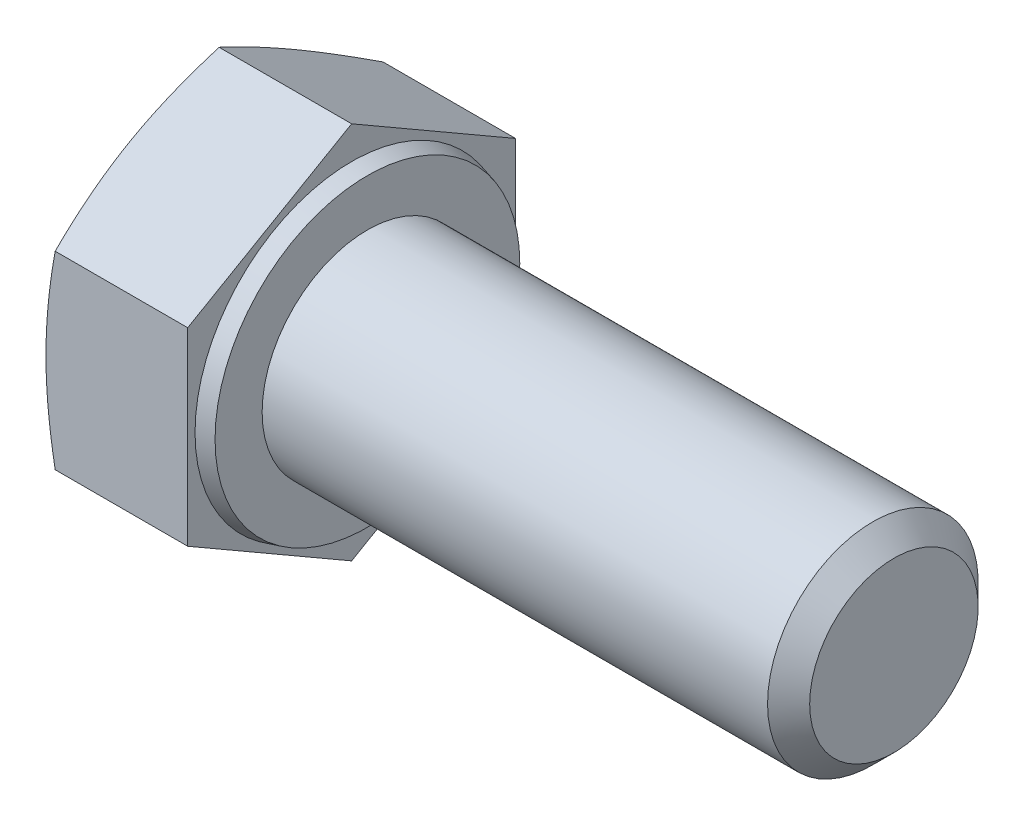
ISO-10303-21;
HEADER;
FILE_DESCRIPTION(('STEP AP214'),'2;1');
FILE_NAME('part.step','',(''),(''),'','','');
FILE_SCHEMA(('AUTOMOTIVE_DESIGN { 1 0 10303 214 1 1 1 1 }'));
ENDSEC;
DATA;
#1=APPLICATION_CONTEXT('core data for automotive mechanical design processes');
#2=APPLICATION_PROTOCOL_DEFINITION('international standard','automotive_design',2000,#1);
#3=PRODUCT_CONTEXT('',#1,'mechanical');
#4=PRODUCT('Part','Part','',(#3));
#5=PRODUCT_RELATED_PRODUCT_CATEGORY('part','',(#4));
#6=PRODUCT_DEFINITION_FORMATION('','',#4);
#7=PRODUCT_DEFINITION_CONTEXT('part definition',#1,'design');
#8=PRODUCT_DEFINITION('design','',#6,#7);
#9=PRODUCT_DEFINITION_SHAPE('','',#8);
#10=(LENGTH_UNIT() NAMED_UNIT(*) SI_UNIT(.MILLI.,.METRE.));
#11=(NAMED_UNIT(*) PLANE_ANGLE_UNIT() SI_UNIT($,.RADIAN.));
#12=(NAMED_UNIT(*) SI_UNIT($,.STERADIAN.) SOLID_ANGLE_UNIT());
#13=UNCERTAINTY_MEASURE_WITH_UNIT(LENGTH_MEASURE(1.E-05),#10,'distance_accuracy_value','');
#14=(GEOMETRIC_REPRESENTATION_CONTEXT(3) GLOBAL_UNCERTAINTY_ASSIGNED_CONTEXT((#13)) GLOBAL_UNIT_ASSIGNED_CONTEXT((#10,
#11,#12)) REPRESENTATION_CONTEXT('',''));
#15=CARTESIAN_POINT('',(0.,0.,0.));
#16=DIRECTION('',(0.,0.,1.));
#17=DIRECTION('',(1.,0.,0.));
#18=AXIS2_PLACEMENT_3D('',#15,#16,#17);
#19=CARTESIAN_POINT('',(20.6,-3.595,-6.22672265321011));
#20=DIRECTION('',(0.,-0.866025403784439,-0.5));
#21=DIRECTION('',(0.,0.5,-0.866025403784439));
#22=AXIS2_PLACEMENT_3D('',#19,#20,#21);
#23=PLANE('',#22);
#24=DIRECTION('',(-1.,0.,0.));
#25=VECTOR('',#24,1.);
#26=CARTESIAN_POINT('',(20.6,-7.19,0.));
#27=LINE('',#26,#25);
#28=CARTESIAN_POINT('',(0.,-7.19,0.));
#29=VERTEX_POINT('',#28);
#30=CARTESIAN_POINT('',(-5.03389102967511,-7.19,0.));
#31=VERTEX_POINT('',#30);
#32=EDGE_CURVE('E57',#29,#31,#27,.T.);
#33=ORIENTED_EDGE('',*,*,#32,.T.);
#34=CARTESIAN_POINT('',(-5.03384900100014,-7.19011547005384,0.0002));
#35=CARTESIAN_POINT('',(-5.08805963076519,-7.04122910407722,-0.257678750425791));
#36=CARTESIAN_POINT('',(-5.13737359308155,-6.89185177286806,-0.516407877579102));
#37=CARTESIAN_POINT('',(-5.22413389520894,-6.59212583670845,-1.0355484273537));
#38=CARTESIAN_POINT('',(-5.26157094835133,-6.44177656505055,-1.29596100474615));
#39=CARTESIAN_POINT('',(-5.32212431475841,-6.14177529234696,-1.81557845140411));
#40=CARTESIAN_POINT('',(-5.34537270513493,-5.99213014273963,-2.07477145363024));
#41=CARTESIAN_POINT('',(-5.37655533214507,-5.69248989384581,-2.59376358870692));
#42=CARTESIAN_POINT('',(-5.38449531124956,-5.54249494692291,-2.85356245765599));
#43=CARTESIAN_POINT('',(-5.38449531124956,-5.2425050530771,-3.37316019555412));
#44=CARTESIAN_POINT('',(-5.37655533214507,-5.09251010615419,-3.63295906450319));
#45=CARTESIAN_POINT('',(-5.34537270513493,-4.79286985726037,-4.15195119957987));
#46=CARTESIAN_POINT('',(-5.32212431475841,-4.64322470765305,-4.41114420180601));
#47=CARTESIAN_POINT('',(-5.26157094835133,-4.34322343494945,-4.93076164846397));
#48=CARTESIAN_POINT('',(-5.22413389520894,-4.19287416329156,-5.19117422585641));
#49=CARTESIAN_POINT('',(-5.13737359308155,-3.89314822713194,-5.71031477563101));
#50=CARTESIAN_POINT('',(-5.08805963076518,-3.74377089592278,-5.96904390278432));
#51=CARTESIAN_POINT('',(-5.03384900100014,-3.59488452994616,-6.22692265321011));
#52=B_SPLINE_CURVE_WITH_KNOTS('',3,(#34,#35,#36,#37,#38,#39,#40,#41,#42,#43,#44,#45,#46,#47,#48,
#49,#50,#51),.UNSPECIFIED.,.F.,.F.,(4,2,2,2,2,2,2,2,4),(0.,0.908095057252449,1.81689842260343,
2.71710763162562,3.61697908961632,4.51685054760702,5.41705975662921,6.32586312198019,
7.23395817923264),.UNSPECIFIED.);
#53=CARTESIAN_POINT('',(-5.03389102967511,-3.595,-6.22672265321011));
#54=VERTEX_POINT('',#53);
#55=EDGE_CURVE('E50',#31,#54,#52,.T.);
#56=ORIENTED_EDGE('',*,*,#55,.T.);
#57=DIRECTION('',(-1.,0.,0.));
#58=VECTOR('',#57,1.);
#59=CARTESIAN_POINT('',(20.6,-3.595,-6.22672265321011));
#60=LINE('',#59,#58);
#61=CARTESIAN_POINT('',(0.,-3.595,-6.22672265321011));
#62=VERTEX_POINT('',#61);
#63=EDGE_CURVE('E123',#62,#54,#60,.T.);
#64=ORIENTED_EDGE('',*,*,#63,.F.);
#65=DIRECTION('',(0.,-0.5,0.866025403784439));
#66=VECTOR('',#65,1.);
#67=CARTESIAN_POINT('',(0.,-3.595,-6.22672265321011));
#68=LINE('',#67,#66);
#69=EDGE_CURVE('E138',#62,#29,#68,.T.);
#70=ORIENTED_EDGE('',*,*,#69,.T.);
#71=EDGE_LOOP('',(#33,#56,#64,#70));
#72=FACE_BOUND('',#71,.T.);
#73=ADVANCED_FACE('F35',(#72),#23,.T.);
#74=CARTESIAN_POINT('',(20.6,3.595,-6.22672265321011));
#75=DIRECTION('',(0.,0.,-1.));
#76=DIRECTION('',(0.,1.,0.));
#77=AXIS2_PLACEMENT_3D('',#74,#75,#76);
#78=PLANE('',#77);
#79=ORIENTED_EDGE('',*,*,#63,.T.);
#80=CARTESIAN_POINT('',(-3.51290350463359,-9.51206244699165,-6.22672265321012));
#81=CARTESIAN_POINT('',(-3.59865067374366,-9.23040678020694,-6.22672265321012));
#82=CARTESIAN_POINT('',(-3.68339590180722,-8.948440403835,-6.22672265321012));
#83=CARTESIAN_POINT('',(-3.85032818164455,-8.38372806074036,-6.22672265321012));
#84=CARTESIAN_POINT('',(-3.93251503051058,-8.10098203410892,-6.22672265321012));
#85=CARTESIAN_POINT('',(-4.09391336009,-7.53406688733044,-6.22672265321012));
#86=CARTESIAN_POINT('',(-4.17311898619305,-7.24989609436889,-6.22672265321012));
#87=CARTESIAN_POINT('',(-4.32762595897665,-6.68049654285568,-6.22672265321012));
#88=CARTESIAN_POINT('',(-4.40292737592697,-6.39526780344452,-6.22672265321012));
#89=CARTESIAN_POINT('',(-4.54775778410175,-5.82709836820566,-6.22672265321012));
#90=CARTESIAN_POINT('',(-4.61734665667,-5.54417301266554,-6.22672265321011));
#91=CARTESIAN_POINT('',(-4.75059032929027,-4.97691372635876,-6.22672265321011));
#92=CARTESIAN_POINT('',(-4.81424502941142,-4.69257977195632,-6.22672265321011));
#93=CARTESIAN_POINT('',(-4.93413428437026,-4.12244081187139,-6.22672265321011));
#94=CARTESIAN_POINT('',(-4.99037139100831,-3.83663634741487,-6.22672265321011));
#95=CARTESIAN_POINT('',(-5.09371134025047,-3.26336845733878,-6.22672265321011));
#96=CARTESIAN_POINT('',(-5.14081448967723,-2.97590508777835,-6.22672265321011));
#97=CARTESIAN_POINT('',(-5.21930699352353,-2.43170060088507,-6.22672265321011));
#98=CARTESIAN_POINT('',(-5.2518662377399,-2.17512980718482,-6.22672265321011));
#99=CARTESIAN_POINT('',(-5.30696049565407,-1.66090521643882,-6.22672265321011));
#100=CARTESIAN_POINT('',(-5.32949580170818,-1.4032514512001,-6.22672265321011));
#101=CARTESIAN_POINT('',(-5.36345683516162,-0.887383641140857,-6.22672265321011));
#102=CARTESIAN_POINT('',(-5.37489039669814,-0.629170120469072,-6.22672265321011));
#103=CARTESIAN_POINT('',(-5.38606924306082,-0.112487483798661,-6.22672265321011));
#104=CARTESIAN_POINT('',(-5.38581460886695,0.145981630416715,-6.22672265321011));
#105=CARTESIAN_POINT('',(-5.37359991738923,0.663954843197887,-6.22672265321011));
#106=CARTESIAN_POINT('',(-5.36158028737254,0.923457513564079,-6.22672265321011));
#107=CARTESIAN_POINT('',(-5.32638854200036,1.44169898088408,-6.22672265321011));
#108=CARTESIAN_POINT('',(-5.30321615879705,1.70043775934188,-6.22672265321011));
#109=CARTESIAN_POINT('',(-5.24680158753448,2.21702436160621,-6.22672265321011));
#110=CARTESIAN_POINT('',(-5.21355075970606,2.47487122824474,-6.22672265321011));
#111=CARTESIAN_POINT('',(-5.1383262138086,2.98927496857798,-6.22672265321011));
#112=CARTESIAN_POINT('',(-5.09635245030345,3.24583183554621,-6.22672265321011));
#113=CARTESIAN_POINT('',(-5.00254996252867,3.77161154258582,-6.22672265321011));
#114=CARTESIAN_POINT('',(-4.95030790362126,4.0407599866922,-6.22672265321011));
#115=CARTESIAN_POINT('',(-4.83910100557231,4.57767329922066,-6.22672265321011));
#116=CARTESIAN_POINT('',(-4.78013565803658,4.84543806141054,-6.22672265321011));
#117=CARTESIAN_POINT('',(-4.65672193019494,5.37977561536939,-6.22672265321011));
#118=CARTESIAN_POINT('',(-4.59227195307975,5.64634803605647,-6.22672265321011));
#119=CARTESIAN_POINT('',(-4.45893792515359,6.17836938091286,-6.22672265321011));
#120=CARTESIAN_POINT('',(-4.39005398100717,6.44381833194503,-6.22672265321011));
#121=CARTESIAN_POINT('',(-4.24859250088054,6.97409102138935,-6.22672265321011));
#122=CARTESIAN_POINT('',(-4.17601034700023,7.2389135235188,-6.22672265321011));
#123=CARTESIAN_POINT('',(-4.02789200488949,7.76773266668567,-6.22672265321011));
#124=CARTESIAN_POINT('',(-3.95235577317997,8.0317292955058,-6.22672265321011));
#125=CARTESIAN_POINT('',(-3.7221641328738,8.82257156289593,-6.22672265321011));
#126=CARTESIAN_POINT('',(-3.56389961609156,9.3483659936652,-6.22672265321011));
#127=CARTESIAN_POINT('',(-3.24257396471912,10.3920660350929,-6.22672265321011));
#128=CARTESIAN_POINT('',(-3.07958583733744,10.9099943074093,-6.22672265321011));
#129=CARTESIAN_POINT('',(-2.74898726190027,11.9443978872245,-6.22672265321011));
#130=CARTESIAN_POINT('',(-2.5813765914879,12.4608731235069,-6.22672265321011));
#131=CARTESIAN_POINT('',(-2.24342037080104,13.4907541310804,-6.22672265321011));
#132=CARTESIAN_POINT('',(-2.07308761745729,14.0041641118251,-6.22672265321011));
#133=CARTESIAN_POINT('',(-1.81570195648708,14.77362367697,-6.22672265321011));
#134=CARTESIAN_POINT('',(-1.7295958228759,15.0299906446384,-6.22672265321011));
#135=CARTESIAN_POINT('',(-1.55682750223247,15.5425364828865,-6.22672265321011));
#136=CARTESIAN_POINT('',(-1.47016531655149,15.7987153539217,-6.22672265321011));
#137=CARTESIAN_POINT('',(-1.38326239219643,16.0548125224615,-6.22672265321011));
#138=B_SPLINE_CURVE_WITH_KNOTS('',3,(#80,#81,#82,#83,#84,#85,#86,#87,#88,#89,#90,#91,#92,#93,
#94,#95,#96,#97,#98,#99,#100,#101,#102,#103,#104,#105,#106,#107,#108,#109,#110,#111,#112,#113,
#114,#115,#116,#117,#118,#119,#120,#121,#122,#123,#124,#125,#126,#127,#128,#129,#130,#131,#132,
#133,#134,#135,#136,#137),.UNSPECIFIED.,.F.,.F.,(4,2,2,2,2,2,2,2,2,2,2,2,2,2,2,2,2,2,2,2,2,2,2,
2,2,2,2,2,4),(0.,0.883262987783514,1.76659585051986,2.65158142631617,3.53655106819753,
4.41057390114665,5.28461144989435,6.15834752361641,7.03205424221161,7.80776909780132,
8.58346132755328,9.35860577805133,10.1337448580756,10.9128293116603,11.6919324769004,
12.4717054281399,13.2514824411686,14.0738921575776,14.8963641033477,15.7190763303775,
16.5417687734372,17.3655149556542,18.1892732666067,19.8364902464891,21.4653706257557,
23.094329495726,24.7171047884872,25.5284270364797,26.3397473136057),.UNSPECIFIED.);
#139=CARTESIAN_POINT('',(-5.03389102967511,3.595,-6.22672265321011));
#140=VERTEX_POINT('',#139);
#141=EDGE_CURVE('E179',#54,#140,#138,.T.);
#142=ORIENTED_EDGE('',*,*,#141,.T.);
#143=DIRECTION('',(-1.,0.,0.));
#144=VECTOR('',#143,1.);
#145=CARTESIAN_POINT('',(20.6,3.595,-6.22672265321011));
#146=LINE('',#145,#144);
#147=CARTESIAN_POINT('',(0.,3.595,-6.22672265321011));
#148=VERTEX_POINT('',#147);
#149=EDGE_CURVE('E113',#148,#140,#146,.T.);
#150=ORIENTED_EDGE('',*,*,#149,.F.);
#151=DIRECTION('',(0.,-1.,0.));
#152=VECTOR('',#151,1.);
#153=CARTESIAN_POINT('',(0.,7.19,-6.22672265321011));
#154=LINE('',#153,#152);
#155=EDGE_CURVE('E136',#148,#62,#154,.T.);
#156=ORIENTED_EDGE('',*,*,#155,.T.);
#157=EDGE_LOOP('',(#79,#142,#150,#156));
#158=FACE_BOUND('',#157,.T.);
#159=ADVANCED_FACE('F154',(#158),#78,.T.);
#160=CARTESIAN_POINT('',(20.6,7.19,0.));
#161=DIRECTION('',(0.,0.866025403784438,-0.5));
#162=DIRECTION('',(0.,0.5,0.866025403784439));
#163=AXIS2_PLACEMENT_3D('',#160,#161,#162);
#164=PLANE('',#163);
#165=ORIENTED_EDGE('',*,*,#149,.T.);
#166=CARTESIAN_POINT('',(-5.03384900100014,3.59488452994616,-6.22692265321011));
#167=CARTESIAN_POINT('',(-5.08805963076519,3.74377089592278,-5.96904390278432));
#168=CARTESIAN_POINT('',(-5.13737359308155,3.89314822713194,-5.71031477563101));
#169=CARTESIAN_POINT('',(-5.22413389520894,4.19287416329156,-5.19117422585641));
#170=CARTESIAN_POINT('',(-5.26157094835133,4.34322343494945,-4.93076164846397));
#171=CARTESIAN_POINT('',(-5.32212431475841,4.64322470765305,-4.41114420180601));
#172=CARTESIAN_POINT('',(-5.34537270513493,4.79286985726037,-4.15195119957987));
#173=CARTESIAN_POINT('',(-5.37655533214507,5.09251010615419,-3.63295906450319));
#174=CARTESIAN_POINT('',(-5.38449531124956,5.2425050530771,-3.37316019555412));
#175=CARTESIAN_POINT('',(-5.38449531124956,5.54249494692291,-2.85356245765599));
#176=CARTESIAN_POINT('',(-5.37655533214507,5.69248989384581,-2.59376358870692));
#177=CARTESIAN_POINT('',(-5.34537270513493,5.99213014273963,-2.07477145363024));
#178=CARTESIAN_POINT('',(-5.32212431475841,6.14177529234696,-1.81557845140411));
#179=CARTESIAN_POINT('',(-5.26157094835133,6.44177656505056,-1.29596100474615));
#180=CARTESIAN_POINT('',(-5.22413389520894,6.59212583670845,-1.0355484273537));
#181=CARTESIAN_POINT('',(-5.13737359308155,6.89185177286806,-0.516407877579103));
#182=CARTESIAN_POINT('',(-5.08805963076518,7.04122910407722,-0.257678750425792));
#183=CARTESIAN_POINT('',(-5.03384900100014,7.19011547005384,0.000199999999999125));
#184=B_SPLINE_CURVE_WITH_KNOTS('',3,(#166,#167,#168,#169,#170,#171,#172,#173,#174,#175,#176,
#177,#178,#179,#180,#181,#182,#183),.UNSPECIFIED.,.F.,.F.,(4,2,2,2,2,2,2,2,4),(0.,
0.908095057252449,1.81689842260343,2.71710763162562,3.61697908961632,4.51685054760702,
5.41705975662921,6.32586312198019,7.23395817923264),.UNSPECIFIED.);
#185=CARTESIAN_POINT('',(-5.03389102967511,7.19,0.));
#186=VERTEX_POINT('',#185);
#187=EDGE_CURVE('E106',#140,#186,#184,.T.);
#188=ORIENTED_EDGE('',*,*,#187,.T.);
#189=DIRECTION('',(-1.,0.,0.));
#190=VECTOR('',#189,1.);
#191=CARTESIAN_POINT('',(20.6,7.19,0.));
#192=LINE('',#191,#190);
#193=CARTESIAN_POINT('',(0.,7.19,0.));
#194=VERTEX_POINT('',#193);
#195=EDGE_CURVE('E105',#194,#186,#192,.T.);
#196=ORIENTED_EDGE('',*,*,#195,.F.);
#197=DIRECTION('',(0.,-0.5,-0.866025403784439));
#198=VECTOR('',#197,1.);
#199=CARTESIAN_POINT('',(0.,7.19,0.));
#200=LINE('',#199,#198);
#201=EDGE_CURVE('E134',#194,#148,#200,.T.);
#202=ORIENTED_EDGE('',*,*,#201,.T.);
#203=EDGE_LOOP('',(#165,#188,#196,#202));
#204=FACE_BOUND('',#203,.T.);
#205=ADVANCED_FACE('F160',(#204),#164,.T.);
#206=CARTESIAN_POINT('',(20.6,3.595,6.22672265321012));
#207=DIRECTION('',(0.,0.866025403784439,0.5));
#208=DIRECTION('',(0.,-0.5,0.866025403784439));
#209=AXIS2_PLACEMENT_3D('',#206,#207,#208);
#210=PLANE('',#209);
#211=ORIENTED_EDGE('',*,*,#195,.T.);
#212=CARTESIAN_POINT('',(-5.03384900100014,7.19011547005384,-0.000200000000000765));
#213=CARTESIAN_POINT('',(-5.08805963076518,7.04122910407722,0.25767875042579));
#214=CARTESIAN_POINT('',(-5.13737359308155,6.89185177286806,0.516407877579101));
#215=CARTESIAN_POINT('',(-5.22413389520894,6.59212583670845,1.0355484273537));
#216=CARTESIAN_POINT('',(-5.26157094835133,6.44177656505056,1.29596100474615));
#217=CARTESIAN_POINT('',(-5.32212431475841,6.14177529234696,1.81557845140411));
#218=CARTESIAN_POINT('',(-5.34537270513493,5.99213014273963,2.07477145363024));
#219=CARTESIAN_POINT('',(-5.37655533214507,5.69248989384581,2.59376358870692));
#220=CARTESIAN_POINT('',(-5.38449531124956,5.54249494692291,2.85356245765599));
#221=CARTESIAN_POINT('',(-5.38449531124956,5.2425050530771,3.37316019555412));
#222=CARTESIAN_POINT('',(-5.37655533214507,5.09251010615419,3.63295906450319));
#223=CARTESIAN_POINT('',(-5.34537270513493,4.79286985726037,4.15195119957987));
#224=CARTESIAN_POINT('',(-5.32212431475841,4.64322470765305,4.41114420180601));
#225=CARTESIAN_POINT('',(-5.26157094835133,4.34322343494945,4.93076164846397));
#226=CARTESIAN_POINT('',(-5.22413389520894,4.19287416329156,5.19117422585641));
#227=CARTESIAN_POINT('',(-5.13737359308155,3.89314822713194,5.71031477563101));
#228=CARTESIAN_POINT('',(-5.08805963076518,3.74377089592278,5.96904390278432));
#229=CARTESIAN_POINT('',(-5.03384900100014,3.59488452994616,6.22692265321012));
#230=B_SPLINE_CURVE_WITH_KNOTS('',3,(#212,#213,#214,#215,#216,#217,#218,#219,#220,#221,#222,
#223,#224,#225,#226,#227,#228,#229),.UNSPECIFIED.,.F.,.F.,(4,2,2,2,2,2,2,2,4),(0.,
0.908095057252449,1.81689842260343,2.71710763162562,3.61697908961632,4.51685054760702,
5.41705975662921,6.32586312198019,7.23395817923264),.UNSPECIFIED.);
#231=CARTESIAN_POINT('',(-5.03389102967511,3.595,6.22672265321012));
#232=VERTEX_POINT('',#231);
#233=EDGE_CURVE('E90',#186,#232,#230,.T.);
#234=ORIENTED_EDGE('',*,*,#233,.T.);
#235=DIRECTION('',(-1.,0.,0.));
#236=VECTOR('',#235,1.);
#237=CARTESIAN_POINT('',(20.6,3.595,6.22672265321012));
#238=LINE('',#237,#236);
#239=CARTESIAN_POINT('',(0.,3.595,6.22672265321012));
#240=VERTEX_POINT('',#239);
#241=EDGE_CURVE('E102',#240,#232,#238,.T.);
#242=ORIENTED_EDGE('',*,*,#241,.F.);
#243=DIRECTION('',(0.,0.5,-0.866025403784439));
#244=VECTOR('',#243,1.);
#245=CARTESIAN_POINT('',(0.,7.19,0.));
#246=LINE('',#245,#244);
#247=EDGE_CURVE('E132',#240,#194,#246,.T.);
#248=ORIENTED_EDGE('',*,*,#247,.T.);
#249=EDGE_LOOP('',(#211,#234,#242,#248));
#250=FACE_BOUND('',#249,.T.);
#251=ADVANCED_FACE('F101',(#250),#210,.T.);
#252=CARTESIAN_POINT('',(20.6,-3.595,6.22672265321012));
#253=DIRECTION('',(0.,0.,1.));
#254=DIRECTION('',(1.,0.,0.));
#255=AXIS2_PLACEMENT_3D('',#252,#253,#254);
#256=PLANE('',#255);
#257=ORIENTED_EDGE('',*,*,#241,.T.);
#258=CARTESIAN_POINT('',(-3.51290508611603,-9.51205725371464,6.22672265321012));
#259=CARTESIAN_POINT('',(-3.59865217996763,-9.2304017880567,6.22672265321012));
#260=CARTESIAN_POINT('',(-3.68339733297397,-8.94843561292577,6.22672265321012));
#261=CARTESIAN_POINT('',(-3.85032946359841,-8.38372367274364,6.22672265321012));
#262=CARTESIAN_POINT('',(-3.93251623830892,-8.10097784778373,6.22672265321012));
#263=CARTESIAN_POINT('',(-4.09391442059783,-7.53406310622304,6.22672265321012));
#264=CARTESIAN_POINT('',(-4.17311997357866,-7.24989251681173,6.22672265321012));
#265=CARTESIAN_POINT('',(-4.32762680242183,-6.68049337324663,6.22672265321012));
#266=CARTESIAN_POINT('',(-4.40292814855382,-6.3952648382333,6.22672265321012));
#267=CARTESIAN_POINT('',(-4.54775841953013,-5.82709581042908,6.22672265321012));
#268=CARTESIAN_POINT('',(-4.61734722567375,-5.54417065791081,6.22672265321012));
#269=CARTESIAN_POINT('',(-4.75059077074392,-4.97691177927585,6.22672265321012));
#270=CARTESIAN_POINT('',(-4.81424540974025,-4.69257802952355,6.22672265321012));
#271=CARTESIAN_POINT('',(-4.93413455045104,-4.12243948030663,6.22672265321012));
#272=CARTESIAN_POINT('',(-4.99037160395253,-3.83663522206503,6.22672265321012));
#273=CARTESIAN_POINT('',(-5.09371145826456,-3.26336774677179,6.22672265321012));
#274=CARTESIAN_POINT('',(-5.14081456589485,-2.97590458577873,6.22672265321012));
#275=CARTESIAN_POINT('',(-5.21930703944179,-2.43170025907276,6.22672265321012));
#276=CARTESIAN_POINT('',(-5.25186628549319,-2.17512941557449,6.22672265321012));
#277=CARTESIAN_POINT('',(-5.30696054251941,-1.66090472496614,6.22672265321012));
#278=CARTESIAN_POINT('',(-5.32949584585066,-1.40325090966308,6.22672265321012));
#279=CARTESIAN_POINT('',(-5.36345686891723,-0.88738299958265,6.22672265321012));
#280=CARTESIAN_POINT('',(-5.37489042279491,-0.62916942895409,6.22672265321012));
#281=CARTESIAN_POINT('',(-5.38606924904272,-0.112486692775754,6.22672265321012));
#282=CARTESIAN_POINT('',(-5.38581460239283,0.145982470990777,6.22672265321012));
#283=CARTESIAN_POINT('',(-5.37359988177924,0.663955784214362,6.22672265321012));
#284=CARTESIAN_POINT('',(-5.36158023497983,0.923458505466206,6.22672265321012));
#285=CARTESIAN_POINT('',(-5.3263884528181,1.44170007368661,6.22672265321012));
#286=CARTESIAN_POINT('',(-5.30321604960751,1.7004389021591,6.22672265321012));
#287=CARTESIAN_POINT('',(-5.24680143623883,2.21702560380556,6.22672265321012));
#288=CARTESIAN_POINT('',(-5.21355058630372,2.47487251981011,6.22672265321012));
#289=CARTESIAN_POINT('',(-5.13832599511556,2.98927635818654,6.22672265321012));
#290=CARTESIAN_POINT('',(-5.09635220842638,3.24583327383193,6.22672265321012));
#291=CARTESIAN_POINT('',(-5.00254968168844,3.77161302966225,6.22672265321012));
#292=CARTESIAN_POINT('',(-4.95030760851958,4.04076147413116,6.22672265321012));
#293=CARTESIAN_POINT('',(-4.83910068432238,4.57767478754593,6.22672265321012));
#294=CARTESIAN_POINT('',(-4.7801353249004,4.8454395502597,6.22672265321012));
#295=CARTESIAN_POINT('',(-4.65672157529754,5.37977710544744,6.22672265321012));
#296=CARTESIAN_POINT('',(-4.59227158830931,5.64634952683991,6.22672265321012));
#297=CARTESIAN_POINT('',(-4.45893754227179,6.17837087337752,6.22672265321012));
#298=CARTESIAN_POINT('',(-4.39005358988696,6.4438198253855,6.22672265321012));
#299=CARTESIAN_POINT('',(-4.24859209472407,6.97409251652315,6.22672265321012));
#300=CARTESIAN_POINT('',(-4.17600993405459,7.2389150193723,6.22672265321012));
#301=CARTESIAN_POINT('',(-4.02789157942869,7.76773416420793,6.22672265321012));
#302=CARTESIAN_POINT('',(-3.95235534199323,8.03173079397712,6.22672265321012));
#303=CARTESIAN_POINT('',(-3.72216368574898,8.8225730645819,6.22672265321012));
#304=CARTESIAN_POINT('',(-3.5638991600107,9.34836749791472,6.22672265321012));
#305=CARTESIAN_POINT('',(-3.2425734978752,10.3920675289828,6.22672265321012));
#306=CARTESIAN_POINT('',(-3.07958536886221,10.9099957884314,6.22672265321012));
#307=CARTESIAN_POINT('',(-2.74898679178007,11.9443993429674,6.22672265321012));
#308=CARTESIAN_POINT('',(-2.58137612135426,12.4608745668382,6.22672265321012));
#309=CARTESIAN_POINT('',(-2.24341990106824,13.4907555519379,6.22672265321012));
#310=CARTESIAN_POINT('',(-2.07308714812183,14.0041655226146,6.22672265321012));
#311=CARTESIAN_POINT('',(-1.81570148828254,14.7736250728444,6.22672265321012));
#312=CARTESIAN_POINT('',(-1.72959535513498,15.0299920355796,6.22672265321012));
#313=CARTESIAN_POINT('',(-1.55682703557139,15.542537864011,6.22672265321012));
#314=CARTESIAN_POINT('',(-1.47016485050663,15.7987167301625,6.22672265321012));
#315=CARTESIAN_POINT('',(-1.38326192683059,16.0548138938391,6.22672265321012));
#316=B_SPLINE_CURVE_WITH_KNOTS('',3,(#258,#259,#260,#261,#262,#263,#264,#265,#266,#267,#268,
#269,#270,#271,#272,#273,#274,#275,#276,#277,#278,#279,#280,#281,#282,#283,#284,#285,#286,#287,
#288,#289,#290,#291,#292,#293,#294,#295,#296,#297,#298,#299,#300,#301,#302,#303,#304,#305,#306,
#307,#308,#309,#310,#311,#312,#313,#314,#315),.UNSPECIFIED.,.F.,.F.,(4,2,2,2,2,2,2,2,2,2,2,2,2,
2,2,2,2,2,2,2,2,2,2,2,2,2,2,2,4),(0.,0.883262344799887,1.76659456447282,2.6515794931495,
3.53654848794066,4.41057068190114,5.28460759156824,6.15834302768208,7.03204910893083,
7.80776411328184,8.58345649179181,9.35860109082504,10.1337403193849,10.9128249276724,
11.6919282476459,12.471701354226,13.2514785225995,14.0738882483056,14.8963602033275,
15.7190724394093,16.5417648915329,17.365511081231,18.1892693996557,19.8364863946962,
21.4653667386268,23.0943255732039,24.7171008369271,25.5284230704479,26.3397433331034),.UNSPECIFIED.);
#317=CARTESIAN_POINT('',(-5.03389102967511,-3.595,6.22672265321011));
#318=VERTEX_POINT('',#317);
#319=EDGE_CURVE('E86',#232,#318,#316,.F.);
#320=ORIENTED_EDGE('',*,*,#319,.T.);
#321=DIRECTION('',(-1.,0.,0.));
#322=VECTOR('',#321,1.);
#323=CARTESIAN_POINT('',(20.6,-3.595,6.22672265321012));
#324=LINE('',#323,#322);
#325=CARTESIAN_POINT('',(0.,-3.595,6.22672265321012));
#326=VERTEX_POINT('',#325);
#327=EDGE_CURVE('E111',#326,#318,#324,.T.);
#328=ORIENTED_EDGE('',*,*,#327,.F.);
#329=DIRECTION('',(0.,1.,0.));
#330=VECTOR('',#329,1.);
#331=CARTESIAN_POINT('',(0.,7.19,6.22672265321012));
#332=LINE('',#331,#330);
#333=EDGE_CURVE('E110',#326,#240,#332,.T.);
#334=ORIENTED_EDGE('',*,*,#333,.T.);
#335=EDGE_LOOP('',(#257,#320,#328,#334));
#336=FACE_BOUND('',#335,.T.);
#337=ADVANCED_FACE('F108',(#336),#256,.T.);
#338=CARTESIAN_POINT('',(20.6,-7.19,0.));
#339=DIRECTION('',(0.,-0.866025403784439,0.5));
#340=DIRECTION('',(0.,-0.5,-0.866025403784439));
#341=AXIS2_PLACEMENT_3D('',#338,#339,#340);
#342=PLANE('',#341);
#343=ORIENTED_EDGE('',*,*,#327,.T.);
#344=CARTESIAN_POINT('',(-5.03384900100014,-3.59488452994616,6.22692265321012));
#345=CARTESIAN_POINT('',(-5.08805963076519,-3.74377089592278,5.96904390278433));
#346=CARTESIAN_POINT('',(-5.13737359308155,-3.89314822713194,5.71031477563101));
#347=CARTESIAN_POINT('',(-5.22413389520894,-4.19287416329155,5.19117422585641));
#348=CARTESIAN_POINT('',(-5.26157094835133,-4.34322343494944,4.93076164846397));
#349=CARTESIAN_POINT('',(-5.32212431475841,-4.64322470765304,4.41114420180601));
#350=CARTESIAN_POINT('',(-5.34537270513493,-4.79286985726037,4.15195119957987));
#351=CARTESIAN_POINT('',(-5.37655533214507,-5.09251010615419,3.63295906450319));
#352=CARTESIAN_POINT('',(-5.38449531124956,-5.2425050530771,3.37316019555413));
#353=CARTESIAN_POINT('',(-5.38449531124956,-5.5424949469229,2.85356245765599));
#354=CARTESIAN_POINT('',(-5.37655533214507,-5.69248989384581,2.59376358870692));
#355=CARTESIAN_POINT('',(-5.34537270513493,-5.99213014273963,2.07477145363024));
#356=CARTESIAN_POINT('',(-5.32212431475841,-6.14177529234696,1.81557845140411));
#357=CARTESIAN_POINT('',(-5.26157094835133,-6.44177656505055,1.29596100474615));
#358=CARTESIAN_POINT('',(-5.22413389520894,-6.59212583670844,1.0355484273537));
#359=CARTESIAN_POINT('',(-5.13737359308155,-6.89185177286806,0.516407877579102));
#360=CARTESIAN_POINT('',(-5.08805963076519,-7.04122910407722,0.257678750425791));
#361=CARTESIAN_POINT('',(-5.03384900100014,-7.19011547005384,-0.000199999999999902));
#362=B_SPLINE_CURVE_WITH_KNOTS('',3,(#344,#345,#346,#347,#348,#349,#350,#351,#352,#353,#354,
#355,#356,#357,#358,#359,#360,#361),.UNSPECIFIED.,.F.,.F.,(4,2,2,2,2,2,2,2,4),(0.,
0.908095057252449,1.81689842260343,2.71710763162562,3.61697908961632,4.51685054760702,
5.41705975662921,6.32586312198019,7.23395817923264),.UNSPECIFIED.);
#363=EDGE_CURVE('E92',#318,#31,#362,.T.);
#364=ORIENTED_EDGE('',*,*,#363,.T.);
#365=ORIENTED_EDGE('',*,*,#32,.F.);
#366=DIRECTION('',(0.,0.5,0.866025403784439));
#367=VECTOR('',#366,1.);
#368=CARTESIAN_POINT('',(0.,-3.595,6.22672265321011));
#369=LINE('',#368,#367);
#370=EDGE_CURVE('E129',#29,#326,#369,.T.);
#371=ORIENTED_EDGE('',*,*,#370,.T.);
#372=EDGE_LOOP('',(#343,#364,#365,#371));
#373=FACE_BOUND('',#372,.T.);
#374=ADVANCED_FACE('F166',(#373),#342,.T.);
#375=CARTESIAN_POINT('',(0.,7.19,0.));
#376=DIRECTION('',(-1.,0.,0.));
#377=DIRECTION('',(0.,0.,1.));
#378=AXIS2_PLACEMENT_3D('',#375,#376,#377);
#379=PLANE('',#378);
#380=CARTESIAN_POINT('',(0.,0.,0.));
#381=DIRECTION('',(-1.,0.,0.));
#382=DIRECTION('',(0.,0.,1.));
#383=AXIS2_PLACEMENT_3D('',#380,#381,#382);
#384=CIRCLE('',#383,5.94897459621555);
#385=CARTESIAN_POINT('',(0.,0.,5.94897459621555));
#386=VERTEX_POINT('',#385);
#387=EDGE_CURVE('E126',#386,#386,#384,.T.);
#388=ORIENTED_EDGE('',*,*,#387,.T.);
#389=EDGE_LOOP('',(#388));
#390=FACE_BOUND('',#389,.T.);
#391=ORIENTED_EDGE('',*,*,#69,.F.);
#392=ORIENTED_EDGE('',*,*,#155,.F.);
#393=ORIENTED_EDGE('',*,*,#201,.F.);
#394=ORIENTED_EDGE('',*,*,#247,.F.);
#395=ORIENTED_EDGE('',*,*,#333,.F.);
#396=ORIENTED_EDGE('',*,*,#370,.F.);
#397=EDGE_LOOP('',(#391,#392,#393,#394,#395,#396));
#398=FACE_BOUND('',#397,.T.);
#399=ADVANCED_FACE('F223',(#390,#398),#379,.F.);
#400=CARTESIAN_POINT('',(0.599999999999934,0.,0.));
#401=DIRECTION('',(-1.,0.,0.));
#402=DIRECTION('',(0.,0.,1.));
#403=AXIS2_PLACEMENT_3D('',#400,#401,#402);
#404=CONICAL_SURFACE('',#403,5.78820508075687,0.261799387799173);
#405=ORIENTED_EDGE('',*,*,#387,.F.);
#406=EDGE_LOOP('',(#405));
#407=FACE_BOUND('',#406,.T.);
#408=CARTESIAN_POINT('',(0.599999999999934,0.,0.));
#409=DIRECTION('',(-1.,0.,0.));
#410=DIRECTION('',(0.,0.,1.));
#411=AXIS2_PLACEMENT_3D('',#408,#409,#410);
#412=CIRCLE('',#411,5.78820508075687);
#413=CARTESIAN_POINT('',(0.599999999999934,0.,5.78820508075687));
#414=VERTEX_POINT('',#413);
#415=EDGE_CURVE('E122',#414,#414,#412,.T.);
#416=ORIENTED_EDGE('',*,*,#415,.T.);
#417=EDGE_LOOP('',(#416));
#418=FACE_BOUND('',#417,.T.);
#419=ADVANCED_FACE('F227',(#407,#418),#404,.T.);
#420=CARTESIAN_POINT('',(0.6,5.78820508075687,0.));
#421=DIRECTION('',(-1.,0.,0.));
#422=DIRECTION('',(0.,0.,1.));
#423=AXIS2_PLACEMENT_3D('',#420,#421,#422);
#424=PLANE('',#423);
#425=ORIENTED_EDGE('',*,*,#415,.F.);
#426=EDGE_LOOP('',(#425));
#427=FACE_BOUND('',#426,.T.);
#428=CARTESIAN_POINT('',(0.599999999999934,0.,0.));
#429=DIRECTION('',(-1.,0.,0.));
#430=DIRECTION('',(0.,0.,1.));
#431=AXIS2_PLACEMENT_3D('',#428,#429,#430);
#432=CIRCLE('',#431,4.);
#433=CARTESIAN_POINT('',(0.599999999999934,0.,4.));
#434=VERTEX_POINT('',#433);
#435=EDGE_CURVE('E119',#434,#434,#432,.T.);
#436=ORIENTED_EDGE('',*,*,#435,.T.);
#437=EDGE_LOOP('',(#436));
#438=FACE_BOUND('',#437,.T.);
#439=ADVANCED_FACE('F246',(#427,#438),#424,.F.);
#440=CARTESIAN_POINT('',(-1000.,0.,0.));
#441=DIRECTION('',(-1.,0.,0.));
#442=DIRECTION('',(0.,0.,1.));
#443=AXIS2_PLACEMENT_3D('',#440,#441,#442);
#444=CYLINDRICAL_SURFACE('',#443,4.);
#445=CARTESIAN_POINT('',(19.8,0.,0.));
#446=DIRECTION('',(-1.,0.,0.));
#447=DIRECTION('',(0.,0.,1.));
#448=AXIS2_PLACEMENT_3D('',#445,#446,#447);
#449=CIRCLE('',#448,4.);
#450=CARTESIAN_POINT('',(19.8,0.,4.));
#451=VERTEX_POINT('',#450);
#452=EDGE_CURVE('E43',#451,#451,#449,.T.);
#453=ORIENTED_EDGE('',*,*,#452,.T.);
#454=EDGE_LOOP('',(#453));
#455=FACE_BOUND('',#454,.T.);
#456=ORIENTED_EDGE('',*,*,#435,.F.);
#457=EDGE_LOOP('',(#456));
#458=FACE_BOUND('',#457,.T.);
#459=ADVANCED_FACE('F142',(#455,#458),#444,.T.);
#460=CARTESIAN_POINT('',(20.6,4.,0.));
#461=DIRECTION('',(-1.,0.,0.));
#462=DIRECTION('',(0.,0.,1.));
#463=AXIS2_PLACEMENT_3D('',#460,#461,#462);
#464=PLANE('',#463);
#465=CARTESIAN_POINT('',(20.6,0.,0.));
#466=DIRECTION('',(-1.,0.,0.));
#467=DIRECTION('',(0.,0.,1.));
#468=AXIS2_PLACEMENT_3D('',#465,#466,#467);
#469=CIRCLE('',#468,3.19999999999988);
#470=CARTESIAN_POINT('',(20.6,0.,3.19999999999987));
#471=VERTEX_POINT('',#470);
#472=EDGE_CURVE('E12',#471,#471,#469,.F.);
#473=ORIENTED_EDGE('',*,*,#472,.T.);
#474=EDGE_LOOP('',(#473));
#475=FACE_BOUND('',#474,.T.);
#476=ADVANCED_FACE('F169',(#475),#464,.F.);
#477=CARTESIAN_POINT('',(-5.44999999999995,0.,0.));
#478=DIRECTION('',(1.,0.,0.));
#479=DIRECTION('',(0.,0.,-1.));
#480=AXIS2_PLACEMENT_3D('',#477,#478,#479);
#481=CONICAL_SURFACE('',#480,6.04675,1.22173047639602);
#482=ORIENTED_EDGE('',*,*,#363,.F.);
#483=ORIENTED_EDGE('',*,*,#319,.F.);
#484=ORIENTED_EDGE('',*,*,#233,.F.);
#485=ORIENTED_EDGE('',*,*,#187,.F.);
#486=ORIENTED_EDGE('',*,*,#141,.F.);
#487=ORIENTED_EDGE('',*,*,#55,.F.);
#488=EDGE_LOOP('',(#482,#483,#484,#485,#486,#487));
#489=FACE_BOUND('',#488,.T.);
#490=CARTESIAN_POINT('',(-5.44999999999995,0.,0.));
#491=DIRECTION('',(-1.,0.,0.));
#492=DIRECTION('',(0.,0.,1.));
#493=AXIS2_PLACEMENT_3D('',#490,#491,#492);
#494=CIRCLE('',#493,6.04675);
#495=CARTESIAN_POINT('',(-5.44999999999995,0.,6.04675));
#496=VERTEX_POINT('',#495);
#497=EDGE_CURVE('E240',#496,#496,#494,.T.);
#498=ORIENTED_EDGE('',*,*,#497,.F.);
#499=EDGE_LOOP('',(#498));
#500=FACE_BOUND('',#499,.T.);
#501=ADVANCED_FACE('F88',(#489,#500),#481,.T.);
#502=CARTESIAN_POINT('',(-5.45,0.,0.));
#503=DIRECTION('',(1.,0.,0.));
#504=DIRECTION('',(0.,0.,-1.));
#505=AXIS2_PLACEMENT_3D('',#502,#503,#504);
#506=PLANE('',#505);
#507=ORIENTED_EDGE('',*,*,#497,.T.);
#508=EDGE_LOOP('',(#507));
#509=FACE_BOUND('',#508,.T.);
#510=ADVANCED_FACE('F146',(#509),#506,.F.);
#511=CARTESIAN_POINT('',(19.8,0.,0.));
#512=DIRECTION('',(-1.,0.,0.));
#513=DIRECTION('',(0.,0.,1.));
#514=AXIS2_PLACEMENT_3D('',#511,#512,#513);
#515=CONICAL_SURFACE('',#514,4.,0.78539816339755);
#516=CARTESIAN_POINT('',(20.6,0.,3.19999999999987));
#517=CARTESIAN_POINT('',(20.5916666666667,0.,3.20833333333321));
#518=CARTESIAN_POINT('',(20.5833333333333,0.,3.21666666666654));
#519=CARTESIAN_POINT('',(20.5666666666667,0.,3.23333333333321));
#520=CARTESIAN_POINT('',(20.5583333333333,0.,3.24166666666655));
#521=CARTESIAN_POINT('',(20.5416666666667,0.,3.25833333333322));
#522=CARTESIAN_POINT('',(20.5333333333333,0.,3.26666666666655));
#523=CARTESIAN_POINT('',(20.5166666666667,0.,3.28333333333322));
#524=CARTESIAN_POINT('',(20.5083333333333,0.,3.29166666666656));
#525=CARTESIAN_POINT('',(20.4916666666667,0.,3.30833333333322));
#526=CARTESIAN_POINT('',(20.4833333333333,0.,3.31666666666656));
#527=CARTESIAN_POINT('',(20.4666666666667,0.,3.33333333333323));
#528=CARTESIAN_POINT('',(20.4583333333333,0.,3.34166666666656));
#529=CARTESIAN_POINT('',(20.4416666666667,0.,3.35833333333323));
#530=CARTESIAN_POINT('',(20.4333333333333,0.,3.36666666666657));
#531=CARTESIAN_POINT('',(20.4166666666667,0.,3.38333333333324));
#532=CARTESIAN_POINT('',(20.4083333333333,0.,3.39166666666657));
#533=CARTESIAN_POINT('',(20.3916666666667,0.,3.40833333333324));
#534=CARTESIAN_POINT('',(20.3833333333333,0.,3.41666666666658));
#535=CARTESIAN_POINT('',(20.3666666666667,0.,3.43333333333324));
#536=CARTESIAN_POINT('',(20.3583333333333,0.,3.44166666666658));
#537=CARTESIAN_POINT('',(20.3416666666667,0.,3.45833333333325));
#538=CARTESIAN_POINT('',(20.3333333333333,0.,3.46666666666658));
#539=CARTESIAN_POINT('',(20.3166666666667,0.,3.48333333333325));
#540=CARTESIAN_POINT('',(20.3083333333333,0.,3.49166666666659));
#541=CARTESIAN_POINT('',(20.2916666666667,0.,3.50833333333326));
#542=CARTESIAN_POINT('',(20.2833333333334,0.,3.51666666666659));
#543=CARTESIAN_POINT('',(20.2666666666667,0.,3.53333333333326));
#544=CARTESIAN_POINT('',(20.2583333333334,0.,3.54166666666659));
#545=CARTESIAN_POINT('',(20.2416666666667,0.,3.55833333333326));
#546=CARTESIAN_POINT('',(20.2333333333334,0.,3.5666666666666));
#547=CARTESIAN_POINT('',(20.2166666666667,0.,3.58333333333327));
#548=CARTESIAN_POINT('',(20.2083333333334,0.,3.5916666666666));
#549=CARTESIAN_POINT('',(20.1916666666667,0.,3.60833333333327));
#550=CARTESIAN_POINT('',(20.1833333333334,0.,3.61666666666661));
#551=CARTESIAN_POINT('',(20.1666666666667,0.,3.63333333333327));
#552=CARTESIAN_POINT('',(20.1583333333334,0.,3.64166666666661));
#553=CARTESIAN_POINT('',(20.1416666666667,0.,3.65833333333328));
#554=CARTESIAN_POINT('',(20.1333333333334,0.,3.66666666666661));
#555=CARTESIAN_POINT('',(20.1166666666667,0.,3.68333333333328));
#556=CARTESIAN_POINT('',(20.1083333333334,0.,3.69166666666662));
#557=CARTESIAN_POINT('',(20.0916666666667,0.,3.70833333333329));
#558=CARTESIAN_POINT('',(20.0833333333334,0.,3.71666666666662));
#559=CARTESIAN_POINT('',(20.0666666666667,0.,3.73333333333329));
#560=CARTESIAN_POINT('',(20.0583333333334,0.,3.74166666666663));
#561=CARTESIAN_POINT('',(20.0416666666667,0.,3.75833333333329));
#562=CARTESIAN_POINT('',(20.0333333333334,0.,3.76666666666663));
#563=CARTESIAN_POINT('',(20.0166666666667,0.,3.7833333333333));
#564=CARTESIAN_POINT('',(20.0083333333334,0.,3.79166666666663));
#565=CARTESIAN_POINT('',(19.9916666666667,0.,3.8083333333333));
#566=CARTESIAN_POINT('',(19.9833333333334,0.,3.81666666666664));
#567=CARTESIAN_POINT('',(19.9666666666667,0.,3.83333333333331));
#568=CARTESIAN_POINT('',(19.9583333333334,0.,3.84166666666664));
#569=CARTESIAN_POINT('',(19.9416666666667,0.,3.85833333333331));
#570=CARTESIAN_POINT('',(19.9333333333334,0.,3.86666666666664));
#571=CARTESIAN_POINT('',(19.9166666666667,0.,3.88333333333331));
#572=CARTESIAN_POINT('',(19.9083333333334,0.,3.89166666666665));
#573=CARTESIAN_POINT('',(19.8916666666667,0.,3.90833333333332));
#574=CARTESIAN_POINT('',(19.8833333333334,0.,3.91666666666665));
#575=CARTESIAN_POINT('',(19.8666666666667,0.,3.93333333333332));
#576=CARTESIAN_POINT('',(19.8583333333334,0.,3.94166666666666));
#577=CARTESIAN_POINT('',(19.8416666666667,0.,3.95833333333333));
#578=CARTESIAN_POINT('',(19.8333333333334,0.,3.96666666666666));
#579=CARTESIAN_POINT('',(19.8166666666667,0.,3.98333333333333));
#580=CARTESIAN_POINT('',(19.8083333333334,0.,3.99166666666666));
#581=CARTESIAN_POINT('',(19.8,0.,4.));
#582=B_SPLINE_CURVE_WITH_KNOTS('',3,(#516,#517,#518,#519,#520,#521,#522,#523,#524,#525,#526,
#527,#528,#529,#530,#531,#532,#533,#534,#535,#536,#537,#538,#539,#540,#541,#542,#543,#544,#545,
#546,#547,#548,#549,#550,#551,#552,#553,#554,#555,#556,#557,#558,#559,#560,#561,#562,#563,#564,
#565,#566,#567,#568,#569,#570,#571,#572,#573,#574,#575,#576,#577,#578,#579,#580,#581),
.UNSPECIFIED.,.F.,.F.,(4,2,2,2,2,2,2,2,2,2,2,2,2,2,2,2,2,2,2,2,2,2,2,2,2,2,2,2,2,2,2,2,4),(0.,
0.0353553390593305,0.0707106781186589,0.106066017177989,0.141421356237318,0.176776695296648,
0.212132034355976,0.247487373415307,0.282842712474635,0.318198051533963,0.353553390593294,
0.388908729652622,0.424264068711953,0.459619407771281,0.494974746830611,0.53033008588994,
0.565685424949268,0.601040764008599,0.636396103067927,0.671751442127257,0.707106781186586,
0.742462120245916,0.777817459305244,0.813172798364575,0.848528137423903,0.883883476483231,
0.919238815542562,0.95459415460189,0.989949493661221,1.02530483272055,1.06066017177988,
1.09601551083921,1.13137084989854),.UNSPECIFIED.);
#583=EDGE_CURVE('BSEAM37',#471,#451,#582,.T.);
#584=ORIENTED_EDGE('',*,*,#472,.F.);
#585=ORIENTED_EDGE('',*,*,#452,.F.);
#586=ORIENTED_EDGE('',*,*,#583,.T.);
#587=ORIENTED_EDGE('',*,*,#583,.F.);
#588=EDGE_LOOP('',(#584,#586,#585,#587));
#589=FACE_BOUND('',#588,.T.);
#590=ADVANCED_FACE('F37',(#589),#515,.T.);
#591=CLOSED_SHELL('',(#73,#159,#205,#251,#337,#374,#399,#419,#439,#459,#476,#501,#510,#590));
#592=MANIFOLD_SOLID_BREP('B2',#591);
#593=ADVANCED_BREP_SHAPE_REPRESENTATION('',(#18,#592),#14);
#594=SHAPE_DEFINITION_REPRESENTATION(#9,#593);
ENDSEC;
END-ISO-10303-21;
